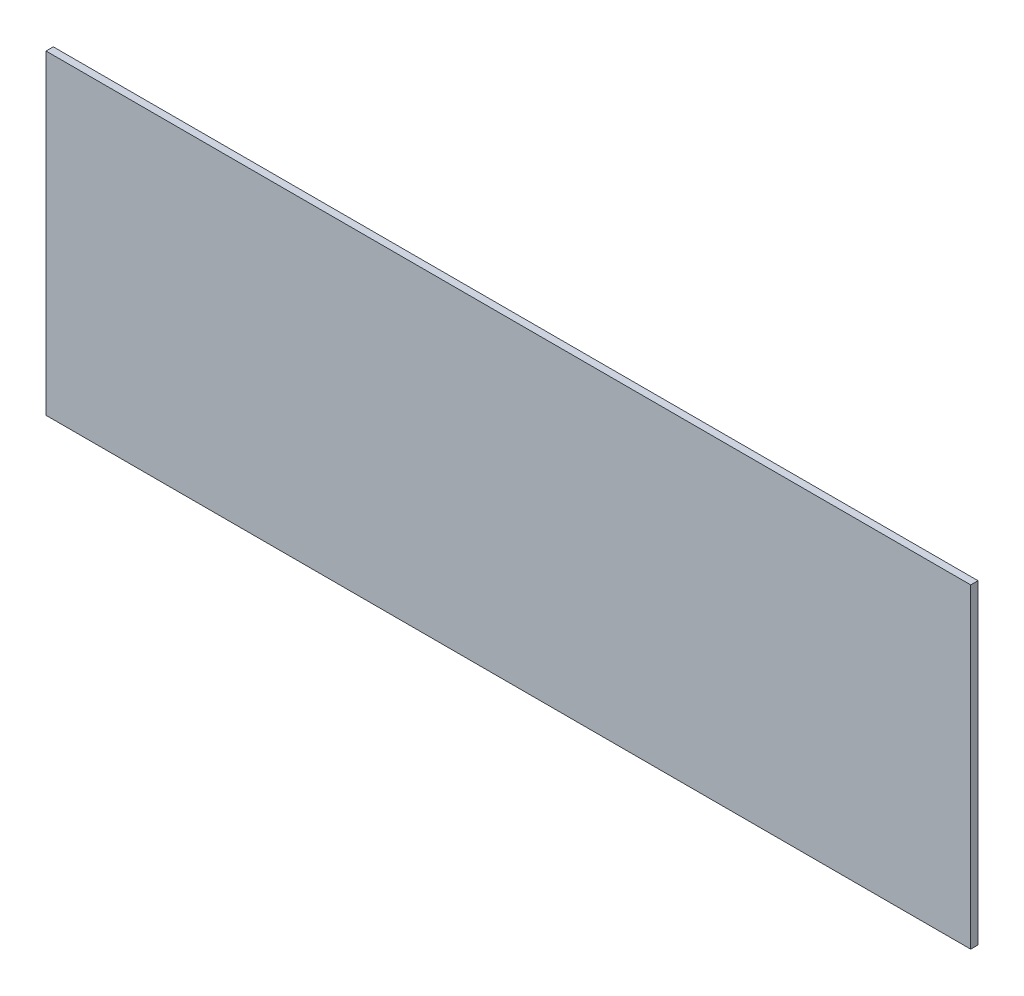
ISO-10303-21;
HEADER;
FILE_DESCRIPTION(('STEP AP214'),'2;1');
FILE_NAME('part.step','',(''),(''),'','','');
FILE_SCHEMA(('AUTOMOTIVE_DESIGN { 1 0 10303 214 1 1 1 1 }'));
ENDSEC;
DATA;
#1=APPLICATION_CONTEXT('core data for automotive mechanical design processes');
#2=APPLICATION_PROTOCOL_DEFINITION('international standard','automotive_design',2000,#1);
#3=PRODUCT_CONTEXT('',#1,'mechanical');
#4=PRODUCT('Part','Part','',(#3));
#5=PRODUCT_RELATED_PRODUCT_CATEGORY('part','',(#4));
#6=PRODUCT_DEFINITION_FORMATION('','',#4);
#7=PRODUCT_DEFINITION_CONTEXT('part definition',#1,'design');
#8=PRODUCT_DEFINITION('design','',#6,#7);
#9=PRODUCT_DEFINITION_SHAPE('','',#8);
#10=(LENGTH_UNIT() NAMED_UNIT(*) SI_UNIT(.MILLI.,.METRE.));
#11=(NAMED_UNIT(*) PLANE_ANGLE_UNIT() SI_UNIT($,.RADIAN.));
#12=(NAMED_UNIT(*) SI_UNIT($,.STERADIAN.) SOLID_ANGLE_UNIT());
#13=UNCERTAINTY_MEASURE_WITH_UNIT(LENGTH_MEASURE(1.E-05),#10,'distance_accuracy_value','');
#14=(GEOMETRIC_REPRESENTATION_CONTEXT(3) GLOBAL_UNCERTAINTY_ASSIGNED_CONTEXT((#13)) GLOBAL_UNIT_ASSIGNED_CONTEXT((#10,
#11,#12)) REPRESENTATION_CONTEXT('',''));
#15=CARTESIAN_POINT('',(0.,0.,0.));
#16=DIRECTION('',(0.,0.,1.));
#17=DIRECTION('',(1.,0.,0.));
#18=AXIS2_PLACEMENT_3D('',#15,#16,#17);
#19=CARTESIAN_POINT('',(95.2500000000001,32.5,1.5));
#20=DIRECTION('',(-1.,0.,0.));
#21=DIRECTION('',(0.,0.,1.));
#22=AXIS2_PLACEMENT_3D('',#19,#20,#21);
#23=PLANE('',#22);
#24=DIRECTION('',(0.,1.,0.));
#25=VECTOR('',#24,1.);
#26=CARTESIAN_POINT('',(95.2500000000001,32.5,0.));
#27=LINE('',#26,#25);
#28=CARTESIAN_POINT('',(95.2500000000001,-32.5,0.));
#29=VERTEX_POINT('',#28);
#30=CARTESIAN_POINT('',(95.2500000000001,32.5,0.));
#31=VERTEX_POINT('',#30);
#32=EDGE_CURVE('E96',#29,#31,#27,.T.);
#33=ORIENTED_EDGE('',*,*,#32,.T.);
#34=DIRECTION('',(0.,0.,-1.));
#35=VECTOR('',#34,1.);
#36=CARTESIAN_POINT('',(95.2500000000001,32.5,1.5));
#37=LINE('',#36,#35);
#38=CARTESIAN_POINT('',(95.2500000000001,32.5,1.5));
#39=VERTEX_POINT('',#38);
#40=EDGE_CURVE('E11',#39,#31,#37,.T.);
#41=ORIENTED_EDGE('',*,*,#40,.F.);
#42=DIRECTION('',(0.,1.,0.));
#43=VECTOR('',#42,1.);
#44=CARTESIAN_POINT('',(95.2500000000001,32.5,1.5));
#45=LINE('',#44,#43);
#46=CARTESIAN_POINT('',(95.2500000000001,-32.5,1.5));
#47=VERTEX_POINT('',#46);
#48=EDGE_CURVE('E84',#47,#39,#45,.T.);
#49=ORIENTED_EDGE('',*,*,#48,.F.);
#50=DIRECTION('',(0.,0.,-1.));
#51=VECTOR('',#50,1.);
#52=CARTESIAN_POINT('',(95.2500000000001,-32.5,1.5));
#53=LINE('',#52,#51);
#54=EDGE_CURVE('E92',#47,#29,#53,.T.);
#55=ORIENTED_EDGE('',*,*,#54,.T.);
#56=EDGE_LOOP('',(#33,#41,#49,#55));
#57=FACE_BOUND('',#56,.T.);
#58=ADVANCED_FACE('F33',(#57),#23,.F.);
#59=CARTESIAN_POINT('',(-95.2499999999999,32.5,1.5));
#60=DIRECTION('',(0.,-1.,0.));
#61=DIRECTION('',(0.,0.,-1.));
#62=AXIS2_PLACEMENT_3D('',#59,#60,#61);
#63=PLANE('',#62);
#64=DIRECTION('',(-1.,0.,0.));
#65=VECTOR('',#64,1.);
#66=CARTESIAN_POINT('',(-95.2499999999999,32.5,0.));
#67=LINE('',#66,#65);
#68=CARTESIAN_POINT('',(-95.2499999999999,32.5,0.));
#69=VERTEX_POINT('',#68);
#70=EDGE_CURVE('E88',#31,#69,#67,.T.);
#71=ORIENTED_EDGE('',*,*,#70,.T.);
#72=DIRECTION('',(0.,0.,-1.));
#73=VECTOR('',#72,1.);
#74=CARTESIAN_POINT('',(-95.2499999999999,32.5,1.5));
#75=LINE('',#74,#73);
#76=CARTESIAN_POINT('',(-95.2499999999999,32.5,1.5));
#77=VERTEX_POINT('',#76);
#78=EDGE_CURVE('E41',#77,#69,#75,.T.);
#79=ORIENTED_EDGE('',*,*,#78,.F.);
#80=DIRECTION('',(-1.,0.,0.));
#81=VECTOR('',#80,1.);
#82=CARTESIAN_POINT('',(-95.2499999999999,32.5,1.5));
#83=LINE('',#82,#81);
#84=EDGE_CURVE('E79',#39,#77,#83,.T.);
#85=ORIENTED_EDGE('',*,*,#84,.F.);
#86=ORIENTED_EDGE('',*,*,#40,.T.);
#87=EDGE_LOOP('',(#71,#79,#85,#86));
#88=FACE_BOUND('',#87,.T.);
#89=ADVANCED_FACE('F87',(#88),#63,.F.);
#90=CARTESIAN_POINT('',(-95.2499999999999,32.5,1.5));
#91=DIRECTION('',(1.,0.,0.));
#92=DIRECTION('',(0.,0.,-1.));
#93=AXIS2_PLACEMENT_3D('',#90,#91,#92);
#94=PLANE('',#93);
#95=DIRECTION('',(0.,-1.,0.));
#96=VECTOR('',#95,1.);
#97=CARTESIAN_POINT('',(-95.2499999999999,32.5,0.));
#98=LINE('',#97,#96);
#99=CARTESIAN_POINT('',(-95.2499999999999,-32.5,0.));
#100=VERTEX_POINT('',#99);
#101=EDGE_CURVE('E66',#69,#100,#98,.T.);
#102=ORIENTED_EDGE('',*,*,#101,.T.);
#103=DIRECTION('',(0.,0.,-1.));
#104=VECTOR('',#103,1.);
#105=CARTESIAN_POINT('',(-95.2499999999999,-32.5,1.5));
#106=LINE('',#105,#104);
#107=CARTESIAN_POINT('',(-95.2499999999999,-32.5,1.5));
#108=VERTEX_POINT('',#107);
#109=EDGE_CURVE('E89',#108,#100,#106,.T.);
#110=ORIENTED_EDGE('',*,*,#109,.F.);
#111=DIRECTION('',(0.,-1.,0.));
#112=VECTOR('',#111,1.);
#113=CARTESIAN_POINT('',(-95.2499999999999,32.5,1.5));
#114=LINE('',#113,#112);
#115=EDGE_CURVE('E82',#77,#108,#114,.T.);
#116=ORIENTED_EDGE('',*,*,#115,.F.);
#117=ORIENTED_EDGE('',*,*,#78,.T.);
#118=EDGE_LOOP('',(#102,#110,#116,#117));
#119=FACE_BOUND('',#118,.T.);
#120=ADVANCED_FACE('F90',(#119),#94,.F.);
#121=CARTESIAN_POINT('',(-95.2499999999999,-32.5,1.5));
#122=DIRECTION('',(0.,1.,0.));
#123=DIRECTION('',(0.,0.,1.));
#124=AXIS2_PLACEMENT_3D('',#121,#122,#123);
#125=PLANE('',#124);
#126=DIRECTION('',(1.,0.,0.));
#127=VECTOR('',#126,1.);
#128=CARTESIAN_POINT('',(-95.2499999999999,-32.5,0.));
#129=LINE('',#128,#127);
#130=EDGE_CURVE('E72',#100,#29,#129,.T.);
#131=ORIENTED_EDGE('',*,*,#130,.T.);
#132=ORIENTED_EDGE('',*,*,#54,.F.);
#133=DIRECTION('',(1.,0.,0.));
#134=VECTOR('',#133,1.);
#135=CARTESIAN_POINT('',(-95.2499999999999,-32.5,1.5));
#136=LINE('',#135,#134);
#137=EDGE_CURVE('E49',#108,#47,#136,.T.);
#138=ORIENTED_EDGE('',*,*,#137,.F.);
#139=ORIENTED_EDGE('',*,*,#109,.T.);
#140=EDGE_LOOP('',(#131,#132,#138,#139));
#141=FACE_BOUND('',#140,.T.);
#142=ADVANCED_FACE('F103',(#141),#125,.F.);
#143=CARTESIAN_POINT('',(0.,0.,1.5));
#144=DIRECTION('',(0.,0.,1.));
#145=DIRECTION('',(1.,0.,0.));
#146=AXIS2_PLACEMENT_3D('',#143,#144,#145);
#147=PLANE('',#146);
#148=ORIENTED_EDGE('',*,*,#48,.T.);
#149=ORIENTED_EDGE('',*,*,#84,.T.);
#150=ORIENTED_EDGE('',*,*,#115,.T.);
#151=ORIENTED_EDGE('',*,*,#137,.T.);
#152=EDGE_LOOP('',(#148,#149,#150,#151));
#153=FACE_BOUND('',#152,.T.);
#154=ADVANCED_FACE('F80',(#153),#147,.T.);
#155=CARTESIAN_POINT('',(0.,0.,0.));
#156=DIRECTION('',(0.,0.,1.));
#157=DIRECTION('',(1.,0.,0.));
#158=AXIS2_PLACEMENT_3D('',#155,#156,#157);
#159=PLANE('',#158);
#160=ORIENTED_EDGE('',*,*,#32,.F.);
#161=ORIENTED_EDGE('',*,*,#130,.F.);
#162=ORIENTED_EDGE('',*,*,#101,.F.);
#163=ORIENTED_EDGE('',*,*,#70,.F.);
#164=EDGE_LOOP('',(#160,#161,#162,#163));
#165=FACE_BOUND('',#164,.T.);
#166=ADVANCED_FACE('F106',(#165),#159,.F.);
#167=CLOSED_SHELL('',(#58,#89,#120,#142,#154,#166));
#168=MANIFOLD_SOLID_BREP('B2',#167);
#169=ADVANCED_BREP_SHAPE_REPRESENTATION('',(#18,#168),#14);
#170=SHAPE_DEFINITION_REPRESENTATION(#9,#169);
ENDSEC;
END-ISO-10303-21;
